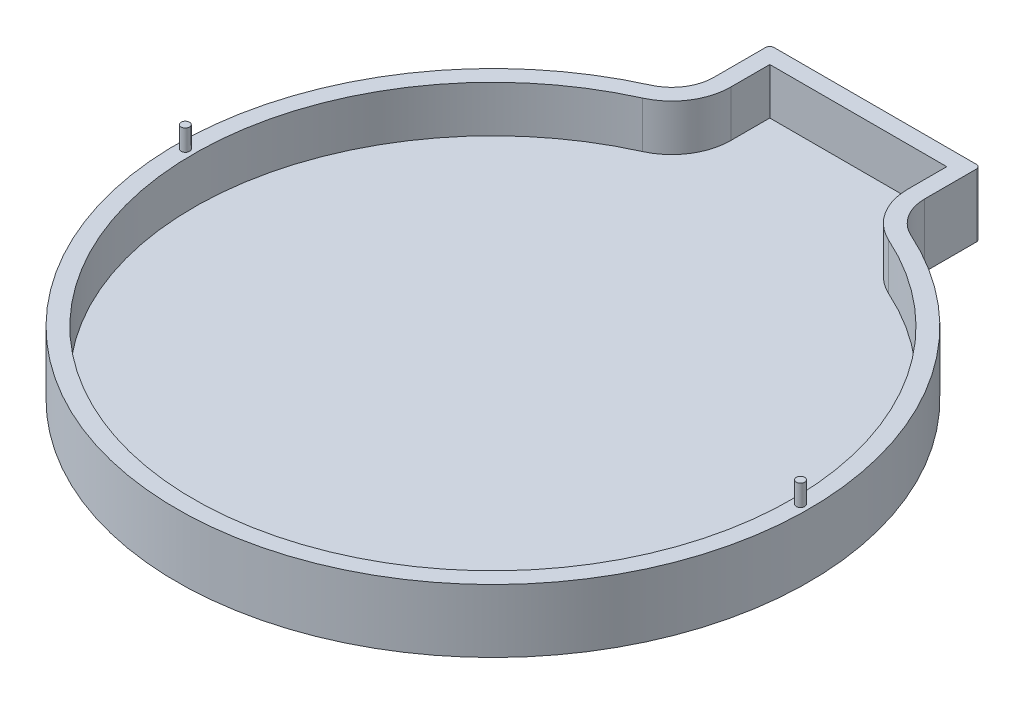
ISO-10303-21;
HEADER;
FILE_DESCRIPTION(('STEP AP214'),'2;1');
FILE_NAME('part.step','',(''),(''),'','','');
FILE_SCHEMA(('AUTOMOTIVE_DESIGN { 1 0 10303 214 1 1 1 1 }'));
ENDSEC;
DATA;
#1=APPLICATION_CONTEXT('core data for automotive mechanical design processes');
#2=APPLICATION_PROTOCOL_DEFINITION('international standard','automotive_design',2000,#1);
#3=PRODUCT_CONTEXT('',#1,'mechanical');
#4=PRODUCT('Part','Part','',(#3));
#5=PRODUCT_RELATED_PRODUCT_CATEGORY('part','',(#4));
#6=PRODUCT_DEFINITION_FORMATION('','',#4);
#7=PRODUCT_DEFINITION_CONTEXT('part definition',#1,'design');
#8=PRODUCT_DEFINITION('design','',#6,#7);
#9=PRODUCT_DEFINITION_SHAPE('','',#8);
#10=(LENGTH_UNIT() NAMED_UNIT(*) SI_UNIT(.MILLI.,.METRE.));
#11=(NAMED_UNIT(*) PLANE_ANGLE_UNIT() SI_UNIT($,.RADIAN.));
#12=(NAMED_UNIT(*) SI_UNIT($,.STERADIAN.) SOLID_ANGLE_UNIT());
#13=UNCERTAINTY_MEASURE_WITH_UNIT(LENGTH_MEASURE(1.E-05),#10,'distance_accuracy_value','');
#14=(GEOMETRIC_REPRESENTATION_CONTEXT(3) GLOBAL_UNCERTAINTY_ASSIGNED_CONTEXT((#13)) GLOBAL_UNIT_ASSIGNED_CONTEXT((#10,
#11,#12)) REPRESENTATION_CONTEXT('',''));
#15=CARTESIAN_POINT('',(0.,0.,0.));
#16=DIRECTION('',(0.,0.,1.));
#17=DIRECTION('',(1.,0.,0.));
#18=AXIS2_PLACEMENT_3D('',#15,#16,#17);
#19=CARTESIAN_POINT('',(24.,15.,-89.7106781186548));
#20=DIRECTION('',(0.,-1.,0.));
#21=DIRECTION('',(0.,0.,-1.));
#22=AXIS2_PLACEMENT_3D('',#19,#20,#21);
#23=PLANE('',#22);
#24=CARTESIAN_POINT('',(73.,15.,0.));
#25=DIRECTION('',(0.,-1.,0.));
#26=DIRECTION('',(0.,0.,-1.));
#27=AXIS2_PLACEMENT_3D('',#24,#25,#26);
#28=CIRCLE('',#27,0.999999999999998);
#29=CARTESIAN_POINT('',(73.,15.,-0.999999999999998));
#30=VERTEX_POINT('',#29);
#31=EDGE_CURVE('E11',#30,#30,#28,.F.);
#32=ORIENTED_EDGE('',*,*,#31,.F.);
#33=EDGE_LOOP('',(#32));
#34=FACE_BOUND('',#33,.T.);
#35=CARTESIAN_POINT('',(-73.,15.,0.));
#36=DIRECTION('',(0.,-1.,0.));
#37=DIRECTION('',(0.,0.,-1.));
#38=AXIS2_PLACEMENT_3D('',#35,#36,#37);
#39=CIRCLE('',#38,0.999999999999998);
#40=CARTESIAN_POINT('',(-73.,15.,-0.999999999999998));
#41=VERTEX_POINT('',#40);
#42=EDGE_CURVE('E43',#41,#41,#39,.F.);
#43=ORIENTED_EDGE('',*,*,#42,.F.);
#44=EDGE_LOOP('',(#43));
#45=FACE_BOUND('',#44,.T.);
#46=CARTESIAN_POINT('',(24.,15.,-89.7106781186548));
#47=DIRECTION('',(0.,1.,0.));
#48=DIRECTION('',(0.,0.,-1.));
#49=AXIS2_PLACEMENT_3D('',#46,#47,#48);
#50=CIRCLE('',#49,1.);
#51=CARTESIAN_POINT('',(25.,15.,-89.7106781186548));
#52=VERTEX_POINT('',#51);
#53=CARTESIAN_POINT('',(24.,15.,-90.7106781186548));
#54=VERTEX_POINT('',#53);
#55=EDGE_CURVE('E195',#52,#54,#50,.T.);
#56=ORIENTED_EDGE('',*,*,#55,.T.);
#57=DIRECTION('',(-1.,0.,0.));
#58=VECTOR('',#57,1.);
#59=CARTESIAN_POINT('',(-24.,15.,-90.7106781186548));
#60=LINE('',#59,#58);
#61=CARTESIAN_POINT('',(-24.,15.,-90.7106781186548));
#62=VERTEX_POINT('',#61);
#63=EDGE_CURVE('E198',#54,#62,#60,.T.);
#64=ORIENTED_EDGE('',*,*,#63,.T.);
#65=CARTESIAN_POINT('',(-24.,15.,-89.7106781186548));
#66=DIRECTION('',(0.,1.,0.));
#67=DIRECTION('',(0.,0.,1.));
#68=AXIS2_PLACEMENT_3D('',#65,#66,#67);
#69=CIRCLE('',#68,1.);
#70=CARTESIAN_POINT('',(-25.,15.,-89.7106781186548));
#71=VERTEX_POINT('',#70);
#72=EDGE_CURVE('E201',#62,#71,#69,.T.);
#73=ORIENTED_EDGE('',*,*,#72,.T.);
#74=DIRECTION('',(0.,0.,1.));
#75=VECTOR('',#74,1.);
#76=CARTESIAN_POINT('',(-25.,15.,-89.7106781186548));
#77=LINE('',#76,#75);
#78=CARTESIAN_POINT('',(-25.,15.,-77.4596669241483));
#79=VERTEX_POINT('',#78);
#80=EDGE_CURVE('E203',#71,#79,#77,.T.);
#81=ORIENTED_EDGE('',*,*,#80,.T.);
#82=CARTESIAN_POINT('',(-35.,15.,-77.4596669241483));
#83=DIRECTION('',(0.,-1.,0.));
#84=DIRECTION('',(0.,0.,-1.));
#85=AXIS2_PLACEMENT_3D('',#82,#83,#84);
#86=CIRCLE('',#85,10.);
#87=CARTESIAN_POINT('',(-30.8823529411765,15.,-68.3467649330721));
#88=VERTEX_POINT('',#87);
#89=EDGE_CURVE('E249',#79,#88,#86,.T.);
#90=ORIENTED_EDGE('',*,*,#89,.T.);
#91=CARTESIAN_POINT('',(0.,15.,0.));
#92=DIRECTION('',(0.,1.,0.));
#93=DIRECTION('',(0.,0.,1.));
#94=AXIS2_PLACEMENT_3D('',#91,#92,#93);
#95=CIRCLE('',#94,75.);
#96=CARTESIAN_POINT('',(30.8823529411765,15.,-68.3467649330721));
#97=VERTEX_POINT('',#96);
#98=EDGE_CURVE('E205',#88,#97,#95,.T.);
#99=ORIENTED_EDGE('',*,*,#98,.T.);
#100=CARTESIAN_POINT('',(35.,15.,-77.4596669241483));
#101=DIRECTION('',(0.,-1.,0.));
#102=DIRECTION('',(0.,0.,-1.));
#103=AXIS2_PLACEMENT_3D('',#100,#101,#102);
#104=CIRCLE('',#103,10.);
#105=CARTESIAN_POINT('',(25.,15.,-77.4596669241483));
#106=VERTEX_POINT('',#105);
#107=EDGE_CURVE('E245',#97,#106,#104,.T.);
#108=ORIENTED_EDGE('',*,*,#107,.T.);
#109=DIRECTION('',(0.,0.,-1.));
#110=VECTOR('',#109,1.);
#111=CARTESIAN_POINT('',(25.,15.,-89.7106781186548));
#112=LINE('',#111,#110);
#113=EDGE_CURVE('E208',#106,#52,#112,.T.);
#114=ORIENTED_EDGE('',*,*,#113,.T.);
#115=EDGE_LOOP('',(#56,#64,#73,#81,#90,#99,#108,#114));
#116=FACE_BOUND('',#115,.T.);
#117=DIRECTION('',(0.,0.,-1.));
#118=VECTOR('',#117,1.);
#119=CARTESIAN_POINT('',(21.,15.,-89.7106781186548));
#120=LINE('',#119,#118);
#121=CARTESIAN_POINT('',(21.,15.,-77.4596669241483));
#122=VERTEX_POINT('',#121);
#123=CARTESIAN_POINT('',(21.,15.,-86.7106781186548));
#124=VERTEX_POINT('',#123);
#125=EDGE_CURVE('E147',#122,#124,#120,.T.);
#126=ORIENTED_EDGE('',*,*,#125,.F.);
#127=CARTESIAN_POINT('',(35.,15.,-77.4596669241483));
#128=DIRECTION('',(0.,-1.,0.));
#129=DIRECTION('',(0.,0.,-1.));
#130=AXIS2_PLACEMENT_3D('',#127,#128,#129);
#131=CIRCLE('',#130,14.);
#132=CARTESIAN_POINT('',(29.2352941176471,15.,-64.7016041366416));
#133=VERTEX_POINT('',#132);
#134=EDGE_CURVE('E177',#133,#122,#131,.T.);
#135=ORIENTED_EDGE('',*,*,#134,.F.);
#136=CARTESIAN_POINT('',(0.,15.,0.));
#137=DIRECTION('',(0.,-1.,0.));
#138=DIRECTION('',(0.,0.,-1.));
#139=AXIS2_PLACEMENT_3D('',#136,#137,#138);
#140=CIRCLE('',#139,71.);
#141=CARTESIAN_POINT('',(-29.2352941176471,15.,-64.7016041366415));
#142=VERTEX_POINT('',#141);
#143=EDGE_CURVE('E50',#142,#133,#140,.F.);
#144=ORIENTED_EDGE('',*,*,#143,.F.);
#145=CARTESIAN_POINT('',(-35.,15.,-77.4596669241483));
#146=DIRECTION('',(0.,-1.,0.));
#147=DIRECTION('',(0.,0.,-1.));
#148=AXIS2_PLACEMENT_3D('',#145,#146,#147);
#149=CIRCLE('',#148,14.);
#150=CARTESIAN_POINT('',(-21.,15.,-77.4596669241483));
#151=VERTEX_POINT('',#150);
#152=EDGE_CURVE('E181',#151,#142,#149,.T.);
#153=ORIENTED_EDGE('',*,*,#152,.F.);
#154=DIRECTION('',(0.,0.,1.));
#155=VECTOR('',#154,1.);
#156=CARTESIAN_POINT('',(-21.,15.,-89.7106781186548));
#157=LINE('',#156,#155);
#158=CARTESIAN_POINT('',(-21.,15.,-86.7106781186548));
#159=VERTEX_POINT('',#158);
#160=EDGE_CURVE('E170',#159,#151,#157,.T.);
#161=ORIENTED_EDGE('',*,*,#160,.F.);
#162=DIRECTION('',(-1.,0.,0.));
#163=VECTOR('',#162,1.);
#164=CARTESIAN_POINT('',(24.,15.,-86.7106781186548));
#165=LINE('',#164,#163);
#166=EDGE_CURVE('E167',#124,#159,#165,.T.);
#167=ORIENTED_EDGE('',*,*,#166,.F.);
#168=EDGE_LOOP('',(#126,#135,#144,#153,#161,#167));
#169=FACE_BOUND('',#168,.T.);
#170=ADVANCED_FACE('F35',(#34,#45,#116,#169),#23,.F.);
#171=CARTESIAN_POINT('',(24.,15.,-89.7106781186548));
#172=DIRECTION('',(0.,-1.,0.));
#173=DIRECTION('',(0.,0.,-1.));
#174=AXIS2_PLACEMENT_3D('',#171,#172,#173);
#175=CYLINDRICAL_SURFACE('',#174,1.);
#176=CARTESIAN_POINT('',(24.,0.,-89.7106781186548));
#177=DIRECTION('',(0.,1.,0.));
#178=DIRECTION('',(0.,0.,-1.));
#179=AXIS2_PLACEMENT_3D('',#176,#177,#178);
#180=CIRCLE('',#179,1.);
#181=CARTESIAN_POINT('',(25.,0.,-89.7106781186548));
#182=VERTEX_POINT('',#181);
#183=CARTESIAN_POINT('',(24.,0.,-90.7106781186548));
#184=VERTEX_POINT('',#183);
#185=EDGE_CURVE('E191',#182,#184,#180,.T.);
#186=ORIENTED_EDGE('',*,*,#185,.T.);
#187=DIRECTION('',(0.,-1.,0.));
#188=VECTOR('',#187,1.);
#189=CARTESIAN_POINT('',(24.,15.,-90.7106781186548));
#190=LINE('',#189,#188);
#191=EDGE_CURVE('E231',#54,#184,#190,.T.);
#192=ORIENTED_EDGE('',*,*,#191,.F.);
#193=ORIENTED_EDGE('',*,*,#55,.F.);
#194=DIRECTION('',(0.,-1.,0.));
#195=VECTOR('',#194,1.);
#196=CARTESIAN_POINT('',(25.,15.,-89.7106781186548));
#197=LINE('',#196,#195);
#198=EDGE_CURVE('E210',#52,#182,#197,.T.);
#199=ORIENTED_EDGE('',*,*,#198,.T.);
#200=EDGE_LOOP('',(#186,#192,#193,#199));
#201=FACE_BOUND('',#200,.T.);
#202=ADVANCED_FACE('F257',(#201),#175,.T.);
#203=CARTESIAN_POINT('',(-24.,15.,-90.7106781186548));
#204=DIRECTION('',(0.,0.,1.));
#205=DIRECTION('',(1.,0.,0.));
#206=AXIS2_PLACEMENT_3D('',#203,#204,#205);
#207=PLANE('',#206);
#208=DIRECTION('',(-1.,0.,0.));
#209=VECTOR('',#208,1.);
#210=CARTESIAN_POINT('',(-24.,0.,-90.7106781186548));
#211=LINE('',#210,#209);
#212=CARTESIAN_POINT('',(-24.,0.,-90.7106781186548));
#213=VERTEX_POINT('',#212);
#214=EDGE_CURVE('E213',#184,#213,#211,.T.);
#215=ORIENTED_EDGE('',*,*,#214,.T.);
#216=DIRECTION('',(0.,-1.,0.));
#217=VECTOR('',#216,1.);
#218=CARTESIAN_POINT('',(-24.,15.,-90.7106781186548));
#219=LINE('',#218,#217);
#220=EDGE_CURVE('E228',#62,#213,#219,.T.);
#221=ORIENTED_EDGE('',*,*,#220,.F.);
#222=ORIENTED_EDGE('',*,*,#63,.F.);
#223=ORIENTED_EDGE('',*,*,#191,.T.);
#224=EDGE_LOOP('',(#215,#221,#222,#223));
#225=FACE_BOUND('',#224,.T.);
#226=ADVANCED_FACE('F306',(#225),#207,.F.);
#227=CARTESIAN_POINT('',(-24.,15.,-89.7106781186548));
#228=DIRECTION('',(0.,-1.,0.));
#229=DIRECTION('',(0.,0.,-1.));
#230=AXIS2_PLACEMENT_3D('',#227,#228,#229);
#231=CYLINDRICAL_SURFACE('',#230,1.);
#232=CARTESIAN_POINT('',(-24.,0.,-89.7106781186548));
#233=DIRECTION('',(0.,1.,0.));
#234=DIRECTION('',(0.,0.,1.));
#235=AXIS2_PLACEMENT_3D('',#232,#233,#234);
#236=CIRCLE('',#235,1.);
#237=CARTESIAN_POINT('',(-25.,0.,-89.7106781186548));
#238=VERTEX_POINT('',#237);
#239=EDGE_CURVE('E215',#213,#238,#236,.T.);
#240=ORIENTED_EDGE('',*,*,#239,.T.);
#241=DIRECTION('',(0.,-1.,0.));
#242=VECTOR('',#241,1.);
#243=CARTESIAN_POINT('',(-25.,15.,-89.7106781186548));
#244=LINE('',#243,#242);
#245=EDGE_CURVE('E225',#71,#238,#244,.T.);
#246=ORIENTED_EDGE('',*,*,#245,.F.);
#247=ORIENTED_EDGE('',*,*,#72,.F.);
#248=ORIENTED_EDGE('',*,*,#220,.T.);
#249=EDGE_LOOP('',(#240,#246,#247,#248));
#250=FACE_BOUND('',#249,.T.);
#251=ADVANCED_FACE('F303',(#250),#231,.T.);
#252=CARTESIAN_POINT('',(-25.,15.,-89.7106781186548));
#253=DIRECTION('',(1.,0.,0.));
#254=DIRECTION('',(0.,0.,-1.));
#255=AXIS2_PLACEMENT_3D('',#252,#253,#254);
#256=PLANE('',#255);
#257=DIRECTION('',(0.,0.,1.));
#258=VECTOR('',#257,1.);
#259=CARTESIAN_POINT('',(-25.,0.,-89.7106781186548));
#260=LINE('',#259,#258);
#261=CARTESIAN_POINT('',(-25.,0.,-77.4596669241483));
#262=VERTEX_POINT('',#261);
#263=EDGE_CURVE('E217',#238,#262,#260,.T.);
#264=ORIENTED_EDGE('',*,*,#263,.T.);
#265=DIRECTION('',(0.,1.,0.));
#266=VECTOR('',#265,1.);
#267=CARTESIAN_POINT('',(-25.,15.,-77.4596669241483));
#268=LINE('',#267,#266);
#269=EDGE_CURVE('E58',#262,#79,#268,.T.);
#270=ORIENTED_EDGE('',*,*,#269,.T.);
#271=ORIENTED_EDGE('',*,*,#80,.F.);
#272=ORIENTED_EDGE('',*,*,#245,.T.);
#273=EDGE_LOOP('',(#264,#270,#271,#272));
#274=FACE_BOUND('',#273,.T.);
#275=ADVANCED_FACE('F299',(#274),#256,.F.);
#276=CARTESIAN_POINT('',(0.,15.,0.));
#277=DIRECTION('',(0.,-1.,0.));
#278=DIRECTION('',(0.,0.,-1.));
#279=AXIS2_PLACEMENT_3D('',#276,#277,#278);
#280=CYLINDRICAL_SURFACE('',#279,75.);
#281=CARTESIAN_POINT('',(0.,0.,0.));
#282=DIRECTION('',(0.,1.,0.));
#283=DIRECTION('',(0.,0.,1.));
#284=AXIS2_PLACEMENT_3D('',#281,#282,#283);
#285=CIRCLE('',#284,75.);
#286=CARTESIAN_POINT('',(-30.8823529411765,0.,-68.3467649330721));
#287=VERTEX_POINT('',#286);
#288=CARTESIAN_POINT('',(30.8823529411765,0.,-68.3467649330721));
#289=VERTEX_POINT('',#288);
#290=EDGE_CURVE('E219',#287,#289,#285,.T.);
#291=ORIENTED_EDGE('',*,*,#290,.T.);
#292=DIRECTION('',(0.,-1.,0.));
#293=VECTOR('',#292,1.);
#294=CARTESIAN_POINT('',(30.8823529411765,15.,-68.3467649330721));
#295=LINE('',#294,#293);
#296=EDGE_CURVE('E240',#289,#97,#295,.F.);
#297=ORIENTED_EDGE('',*,*,#296,.T.);
#298=ORIENTED_EDGE('',*,*,#98,.F.);
#299=DIRECTION('',(0.,-1.,0.));
#300=VECTOR('',#299,1.);
#301=CARTESIAN_POINT('',(-30.8823529411765,15.,-68.3467649330721));
#302=LINE('',#301,#300);
#303=EDGE_CURVE('E237',#88,#287,#302,.T.);
#304=ORIENTED_EDGE('',*,*,#303,.T.);
#305=EDGE_LOOP('',(#291,#297,#298,#304));
#306=FACE_BOUND('',#305,.T.);
#307=ADVANCED_FACE('F295',(#306),#280,.T.);
#308=CARTESIAN_POINT('',(25.,15.,-89.7106781186548));
#309=DIRECTION('',(-1.,0.,0.));
#310=DIRECTION('',(0.,0.,1.));
#311=AXIS2_PLACEMENT_3D('',#308,#309,#310);
#312=PLANE('',#311);
#313=ORIENTED_EDGE('',*,*,#113,.F.);
#314=DIRECTION('',(0.,1.,0.));
#315=VECTOR('',#314,1.);
#316=CARTESIAN_POINT('',(25.,0.,-77.4596669241483));
#317=LINE('',#316,#315);
#318=CARTESIAN_POINT('',(25.,0.,-77.4596669241483));
#319=VERTEX_POINT('',#318);
#320=EDGE_CURVE('E234',#106,#319,#317,.F.);
#321=ORIENTED_EDGE('',*,*,#320,.T.);
#322=DIRECTION('',(0.,0.,-1.));
#323=VECTOR('',#322,1.);
#324=CARTESIAN_POINT('',(25.,0.,-89.7106781186548));
#325=LINE('',#324,#323);
#326=EDGE_CURVE('E199',#319,#182,#325,.T.);
#327=ORIENTED_EDGE('',*,*,#326,.T.);
#328=ORIENTED_EDGE('',*,*,#198,.F.);
#329=EDGE_LOOP('',(#313,#321,#327,#328));
#330=FACE_BOUND('',#329,.T.);
#331=ADVANCED_FACE('F291',(#330),#312,.F.);
#332=CARTESIAN_POINT('',(24.,0.,-89.7106781186548));
#333=DIRECTION('',(0.,-1.,0.));
#334=DIRECTION('',(0.,0.,-1.));
#335=AXIS2_PLACEMENT_3D('',#332,#333,#334);
#336=PLANE('',#335);
#337=ORIENTED_EDGE('',*,*,#185,.F.);
#338=ORIENTED_EDGE('',*,*,#326,.F.);
#339=CARTESIAN_POINT('',(35.,0.,-77.4596669241483));
#340=DIRECTION('',(0.,-1.,0.));
#341=DIRECTION('',(0.,0.,-1.));
#342=AXIS2_PLACEMENT_3D('',#339,#340,#341);
#343=CIRCLE('',#342,10.);
#344=EDGE_CURVE('E243',#319,#289,#343,.F.);
#345=ORIENTED_EDGE('',*,*,#344,.T.);
#346=ORIENTED_EDGE('',*,*,#290,.F.);
#347=CARTESIAN_POINT('',(-35.,0.,-77.4596669241483));
#348=DIRECTION('',(0.,-1.,0.));
#349=DIRECTION('',(0.,0.,-1.));
#350=AXIS2_PLACEMENT_3D('',#347,#348,#349);
#351=CIRCLE('',#350,10.);
#352=EDGE_CURVE('E247',#287,#262,#351,.F.);
#353=ORIENTED_EDGE('',*,*,#352,.T.);
#354=ORIENTED_EDGE('',*,*,#263,.F.);
#355=ORIENTED_EDGE('',*,*,#239,.F.);
#356=ORIENTED_EDGE('',*,*,#214,.F.);
#357=EDGE_LOOP('',(#337,#338,#345,#346,#353,#354,#355,#356));
#358=FACE_BOUND('',#357,.T.);
#359=ADVANCED_FACE('F287',(#358),#336,.T.);
#360=CARTESIAN_POINT('',(35.,15.,-77.4596669241483));
#361=DIRECTION('',(0.,-1.,0.));
#362=DIRECTION('',(0.,0.,-1.));
#363=AXIS2_PLACEMENT_3D('',#360,#361,#362);
#364=CYLINDRICAL_SURFACE('',#363,10.);
#365=ORIENTED_EDGE('',*,*,#107,.F.);
#366=ORIENTED_EDGE('',*,*,#296,.F.);
#367=ORIENTED_EDGE('',*,*,#344,.F.);
#368=ORIENTED_EDGE('',*,*,#320,.F.);
#369=EDGE_LOOP('',(#365,#366,#367,#368));
#370=FACE_BOUND('',#369,.T.);
#371=ADVANCED_FACE('F290',(#370),#364,.F.);
#372=CARTESIAN_POINT('',(-35.,15.,-77.4596669241483));
#373=DIRECTION('',(0.,-1.,0.));
#374=DIRECTION('',(0.,0.,-1.));
#375=AXIS2_PLACEMENT_3D('',#372,#373,#374);
#376=CYLINDRICAL_SURFACE('',#375,10.);
#377=ORIENTED_EDGE('',*,*,#89,.F.);
#378=ORIENTED_EDGE('',*,*,#269,.F.);
#379=ORIENTED_EDGE('',*,*,#352,.F.);
#380=ORIENTED_EDGE('',*,*,#303,.F.);
#381=EDGE_LOOP('',(#377,#378,#379,#380));
#382=FACE_BOUND('',#381,.T.);
#383=ADVANCED_FACE('F37',(#382),#376,.F.);
#384=CARTESIAN_POINT('',(-24.,15.,-86.7106781186548));
#385=DIRECTION('',(0.,0.,1.));
#386=DIRECTION('',(1.,0.,0.));
#387=AXIS2_PLACEMENT_3D('',#384,#385,#386);
#388=PLANE('',#387);
#389=DIRECTION('',(-1.,0.,0.));
#390=VECTOR('',#389,1.);
#391=CARTESIAN_POINT('',(24.,4.,-86.7106781186548));
#392=LINE('',#391,#390);
#393=CARTESIAN_POINT('',(21.,4.,-86.7106781186548));
#394=VERTEX_POINT('',#393);
#395=CARTESIAN_POINT('',(-21.,4.,-86.7106781186548));
#396=VERTEX_POINT('',#395);
#397=EDGE_CURVE('E155',#394,#396,#392,.T.);
#398=ORIENTED_EDGE('',*,*,#397,.F.);
#399=DIRECTION('',(0.,-1.,0.));
#400=VECTOR('',#399,1.);
#401=CARTESIAN_POINT('',(21.,15.,-86.7106781186548));
#402=LINE('',#401,#400);
#403=EDGE_CURVE('E140',#124,#394,#402,.T.);
#404=ORIENTED_EDGE('',*,*,#403,.F.);
#405=ORIENTED_EDGE('',*,*,#166,.T.);
#406=DIRECTION('',(0.,-1.,0.));
#407=VECTOR('',#406,1.);
#408=CARTESIAN_POINT('',(-21.,15.,-86.7106781186548));
#409=LINE('',#408,#407);
#410=EDGE_CURVE('E151',#159,#396,#409,.T.);
#411=ORIENTED_EDGE('',*,*,#410,.T.);
#412=EDGE_LOOP('',(#398,#404,#405,#411));
#413=FACE_BOUND('',#412,.T.);
#414=ADVANCED_FACE('F156',(#413),#388,.T.);
#415=CARTESIAN_POINT('',(-21.,15.,-89.7106781186548));
#416=DIRECTION('',(1.,0.,0.));
#417=DIRECTION('',(0.,0.,-1.));
#418=AXIS2_PLACEMENT_3D('',#415,#416,#417);
#419=PLANE('',#418);
#420=DIRECTION('',(0.,0.,1.));
#421=VECTOR('',#420,1.);
#422=CARTESIAN_POINT('',(-21.,4.,-89.7106781186548));
#423=LINE('',#422,#421);
#424=CARTESIAN_POINT('',(-21.,4.,-77.4596669241483));
#425=VERTEX_POINT('',#424);
#426=EDGE_CURVE('E160',#396,#425,#423,.T.);
#427=ORIENTED_EDGE('',*,*,#426,.F.);
#428=ORIENTED_EDGE('',*,*,#410,.F.);
#429=ORIENTED_EDGE('',*,*,#160,.T.);
#430=DIRECTION('',(0.,1.,0.));
#431=VECTOR('',#430,1.);
#432=CARTESIAN_POINT('',(-21.,15.,-77.4596669241483));
#433=LINE('',#432,#431);
#434=EDGE_CURVE('E175',#425,#151,#433,.T.);
#435=ORIENTED_EDGE('',*,*,#434,.F.);
#436=EDGE_LOOP('',(#427,#428,#429,#435));
#437=FACE_BOUND('',#436,.T.);
#438=ADVANCED_FACE('F267',(#437),#419,.T.);
#439=CARTESIAN_POINT('',(0.,15.,0.));
#440=DIRECTION('',(0.,-1.,0.));
#441=DIRECTION('',(0.,0.,-1.));
#442=AXIS2_PLACEMENT_3D('',#439,#440,#441);
#443=CYLINDRICAL_SURFACE('',#442,71.);
#444=CARTESIAN_POINT('',(0.,4.,0.));
#445=DIRECTION('',(0.,-1.,0.));
#446=DIRECTION('',(0.,0.,-1.));
#447=AXIS2_PLACEMENT_3D('',#444,#445,#446);
#448=CIRCLE('',#447,71.);
#449=CARTESIAN_POINT('',(-29.2352941176471,4.,-64.7016041366415));
#450=VERTEX_POINT('',#449);
#451=CARTESIAN_POINT('',(29.2352941176471,4.,-64.7016041366416));
#452=VERTEX_POINT('',#451);
#453=EDGE_CURVE('E168',#450,#452,#448,.F.);
#454=ORIENTED_EDGE('',*,*,#453,.F.);
#455=DIRECTION('',(0.,-1.,0.));
#456=VECTOR('',#455,1.);
#457=CARTESIAN_POINT('',(-29.2352941176471,15.,-64.7016041366415));
#458=LINE('',#457,#456);
#459=EDGE_CURVE('E184',#142,#450,#458,.T.);
#460=ORIENTED_EDGE('',*,*,#459,.F.);
#461=ORIENTED_EDGE('',*,*,#143,.T.);
#462=DIRECTION('',(0.,-1.,0.));
#463=VECTOR('',#462,1.);
#464=CARTESIAN_POINT('',(29.2352941176471,15.,-64.7016041366416));
#465=LINE('',#464,#463);
#466=EDGE_CURVE('E182',#452,#133,#465,.F.);
#467=ORIENTED_EDGE('',*,*,#466,.F.);
#468=EDGE_LOOP('',(#454,#460,#461,#467));
#469=FACE_BOUND('',#468,.T.);
#470=ADVANCED_FACE('F274',(#469),#443,.F.);
#471=CARTESIAN_POINT('',(21.,15.,-89.7106781186548));
#472=DIRECTION('',(-1.,0.,0.));
#473=DIRECTION('',(0.,0.,1.));
#474=AXIS2_PLACEMENT_3D('',#471,#472,#473);
#475=PLANE('',#474);
#476=ORIENTED_EDGE('',*,*,#125,.T.);
#477=ORIENTED_EDGE('',*,*,#403,.T.);
#478=DIRECTION('',(0.,0.,-1.));
#479=VECTOR('',#478,1.);
#480=CARTESIAN_POINT('',(21.,4.,-89.7106781186548));
#481=LINE('',#480,#479);
#482=CARTESIAN_POINT('',(21.,4.,-77.4596669241483));
#483=VERTEX_POINT('',#482);
#484=EDGE_CURVE('E145',#483,#394,#481,.T.);
#485=ORIENTED_EDGE('',*,*,#484,.F.);
#486=DIRECTION('',(0.,1.,0.));
#487=VECTOR('',#486,1.);
#488=CARTESIAN_POINT('',(21.,15.,-77.4596669241483));
#489=LINE('',#488,#487);
#490=EDGE_CURVE('E150',#122,#483,#489,.F.);
#491=ORIENTED_EDGE('',*,*,#490,.F.);
#492=EDGE_LOOP('',(#476,#477,#485,#491));
#493=FACE_BOUND('',#492,.T.);
#494=ADVANCED_FACE('F142',(#493),#475,.T.);
#495=CARTESIAN_POINT('',(24.,4.,-89.7106781186548));
#496=DIRECTION('',(0.,-1.,0.));
#497=DIRECTION('',(0.,0.,-1.));
#498=AXIS2_PLACEMENT_3D('',#495,#496,#497);
#499=PLANE('',#498);
#500=ORIENTED_EDGE('',*,*,#397,.T.);
#501=ORIENTED_EDGE('',*,*,#426,.T.);
#502=CARTESIAN_POINT('',(-35.,4.,-77.4596669241483));
#503=DIRECTION('',(0.,-1.,0.));
#504=DIRECTION('',(0.,0.,-1.));
#505=AXIS2_PLACEMENT_3D('',#502,#503,#504);
#506=CIRCLE('',#505,14.);
#507=EDGE_CURVE('E179',#450,#425,#506,.F.);
#508=ORIENTED_EDGE('',*,*,#507,.F.);
#509=ORIENTED_EDGE('',*,*,#453,.T.);
#510=CARTESIAN_POINT('',(35.,4.,-77.4596669241483));
#511=DIRECTION('',(0.,-1.,0.));
#512=DIRECTION('',(0.,0.,-1.));
#513=AXIS2_PLACEMENT_3D('',#510,#511,#512);
#514=CIRCLE('',#513,14.);
#515=EDGE_CURVE('E165',#483,#452,#514,.F.);
#516=ORIENTED_EDGE('',*,*,#515,.F.);
#517=ORIENTED_EDGE('',*,*,#484,.T.);
#518=EDGE_LOOP('',(#500,#501,#508,#509,#516,#517));
#519=FACE_BOUND('',#518,.T.);
#520=ADVANCED_FACE('F163',(#519),#499,.F.);
#521=CARTESIAN_POINT('',(35.,15.,-77.4596669241483));
#522=DIRECTION('',(0.,-1.,0.));
#523=DIRECTION('',(0.,0.,-1.));
#524=AXIS2_PLACEMENT_3D('',#521,#522,#523);
#525=CYLINDRICAL_SURFACE('',#524,14.);
#526=ORIENTED_EDGE('',*,*,#134,.T.);
#527=ORIENTED_EDGE('',*,*,#490,.T.);
#528=ORIENTED_EDGE('',*,*,#515,.T.);
#529=ORIENTED_EDGE('',*,*,#466,.T.);
#530=EDGE_LOOP('',(#526,#527,#528,#529));
#531=FACE_BOUND('',#530,.T.);
#532=ADVANCED_FACE('F276',(#531),#525,.T.);
#533=CARTESIAN_POINT('',(-35.,15.,-77.4596669241483));
#534=DIRECTION('',(0.,-1.,0.));
#535=DIRECTION('',(0.,0.,-1.));
#536=AXIS2_PLACEMENT_3D('',#533,#534,#535);
#537=CYLINDRICAL_SURFACE('',#536,14.);
#538=ORIENTED_EDGE('',*,*,#152,.T.);
#539=ORIENTED_EDGE('',*,*,#459,.T.);
#540=ORIENTED_EDGE('',*,*,#507,.T.);
#541=ORIENTED_EDGE('',*,*,#434,.T.);
#542=EDGE_LOOP('',(#538,#539,#540,#541));
#543=FACE_BOUND('',#542,.T.);
#544=ADVANCED_FACE('F272',(#543),#537,.T.);
#545=CARTESIAN_POINT('',(-73.,20.,0.));
#546=DIRECTION('',(0.,-1.,0.));
#547=DIRECTION('',(0.,0.,-1.));
#548=AXIS2_PLACEMENT_3D('',#545,#546,#547);
#549=CYLINDRICAL_SURFACE('',#548,0.999999999999998);
#550=CARTESIAN_POINT('',(-73.,20.,0.));
#551=DIRECTION('',(0.,1.,0.));
#552=DIRECTION('',(0.,0.,1.));
#553=AXIS2_PLACEMENT_3D('',#550,#551,#552);
#554=CIRCLE('',#553,0.999999999999998);
#555=CARTESIAN_POINT('',(-73.,20.,0.999999999999998));
#556=VERTEX_POINT('',#555);
#557=EDGE_CURVE('E161',#556,#556,#554,.T.);
#558=ORIENTED_EDGE('',*,*,#557,.F.);
#559=EDGE_LOOP('',(#558));
#560=FACE_BOUND('',#559,.T.);
#561=ORIENTED_EDGE('',*,*,#42,.T.);
#562=EDGE_LOOP('',(#561));
#563=FACE_BOUND('',#562,.T.);
#564=ADVANCED_FACE('F253',(#560,#563),#549,.T.);
#565=CARTESIAN_POINT('',(-73.,20.,0.));
#566=DIRECTION('',(0.,1.,0.));
#567=DIRECTION('',(0.,0.,1.));
#568=AXIS2_PLACEMENT_3D('',#565,#566,#567);
#569=PLANE('',#568);
#570=ORIENTED_EDGE('',*,*,#557,.T.);
#571=EDGE_LOOP('',(#570));
#572=FACE_BOUND('',#571,.T.);
#573=ADVANCED_FACE('F383',(#572),#569,.T.);
#574=CARTESIAN_POINT('',(73.,20.,0.));
#575=DIRECTION('',(0.,-1.,0.));
#576=DIRECTION('',(0.,0.,-1.));
#577=AXIS2_PLACEMENT_3D('',#574,#575,#576);
#578=CYLINDRICAL_SURFACE('',#577,0.999999999999998);
#579=CARTESIAN_POINT('',(73.,20.,0.));
#580=DIRECTION('',(0.,1.,0.));
#581=DIRECTION('',(0.,0.,1.));
#582=AXIS2_PLACEMENT_3D('',#579,#580,#581);
#583=CIRCLE('',#582,0.999999999999998);
#584=CARTESIAN_POINT('',(73.,20.,0.999999999999998));
#585=VERTEX_POINT('',#584);
#586=EDGE_CURVE('E417',#585,#585,#583,.T.);
#587=ORIENTED_EDGE('',*,*,#586,.F.);
#588=EDGE_LOOP('',(#587));
#589=FACE_BOUND('',#588,.T.);
#590=ORIENTED_EDGE('',*,*,#31,.T.);
#591=EDGE_LOOP('',(#590));
#592=FACE_BOUND('',#591,.T.);
#593=ADVANCED_FACE('F392',(#589,#592),#578,.T.);
#594=CARTESIAN_POINT('',(73.,20.,0.));
#595=DIRECTION('',(0.,1.,0.));
#596=DIRECTION('',(0.,0.,1.));
#597=AXIS2_PLACEMENT_3D('',#594,#595,#596);
#598=PLANE('',#597);
#599=ORIENTED_EDGE('',*,*,#586,.T.);
#600=EDGE_LOOP('',(#599));
#601=FACE_BOUND('',#600,.T.);
#602=ADVANCED_FACE('F401',(#601),#598,.T.);
#603=CLOSED_SHELL('',(#170,#202,#226,#251,#275,#307,#331,#359,#371,#383,#414,#438,#470,#494,
#520,#532,#544,#564,#573,#593,#602));
#604=MANIFOLD_SOLID_BREP('B2',#603);
#605=ADVANCED_BREP_SHAPE_REPRESENTATION('',(#18,#604),#14);
#606=SHAPE_DEFINITION_REPRESENTATION(#9,#605);
ENDSEC;
END-ISO-10303-21;
